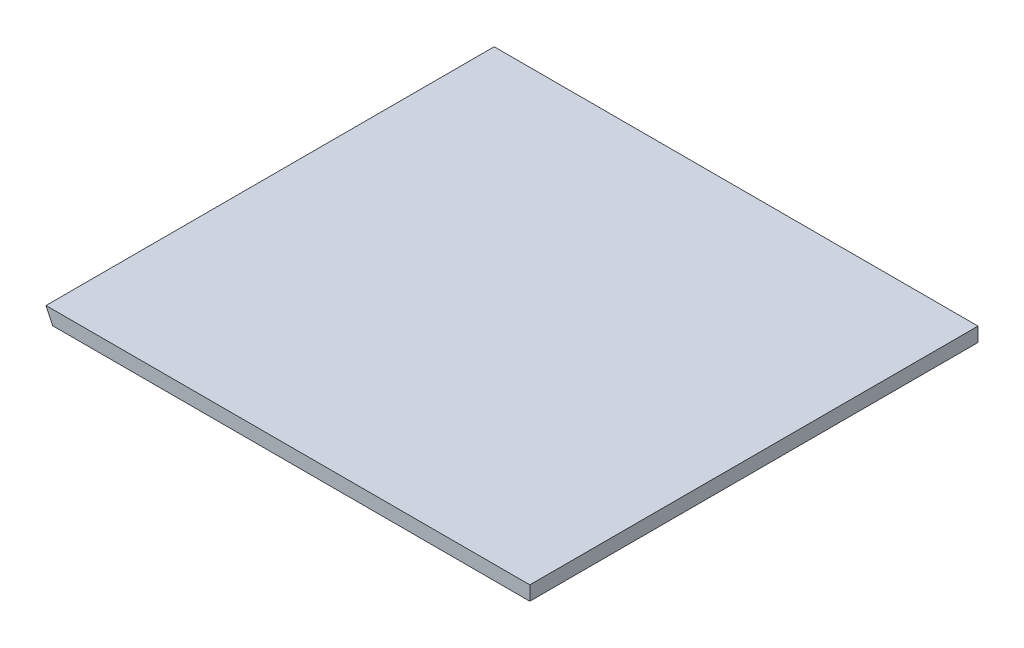
ISO-10303-21;
HEADER;
FILE_DESCRIPTION(('STEP AP214'),'2;1');
FILE_NAME('part.step','',(''),(''),'','','');
FILE_SCHEMA(('AUTOMOTIVE_DESIGN { 1 0 10303 214 1 1 1 1 }'));
ENDSEC;
DATA;
#1=APPLICATION_CONTEXT('core data for automotive mechanical design processes');
#2=APPLICATION_PROTOCOL_DEFINITION('international standard','automotive_design',2000,#1);
#3=PRODUCT_CONTEXT('',#1,'mechanical');
#4=PRODUCT('Part','Part','',(#3));
#5=PRODUCT_RELATED_PRODUCT_CATEGORY('part','',(#4));
#6=PRODUCT_DEFINITION_FORMATION('','',#4);
#7=PRODUCT_DEFINITION_CONTEXT('part definition',#1,'design');
#8=PRODUCT_DEFINITION('design','',#6,#7);
#9=PRODUCT_DEFINITION_SHAPE('','',#8);
#10=(LENGTH_UNIT() NAMED_UNIT(*) SI_UNIT(.MILLI.,.METRE.));
#11=(NAMED_UNIT(*) PLANE_ANGLE_UNIT() SI_UNIT($,.RADIAN.));
#12=(NAMED_UNIT(*) SI_UNIT($,.STERADIAN.) SOLID_ANGLE_UNIT());
#13=UNCERTAINTY_MEASURE_WITH_UNIT(LENGTH_MEASURE(1.E-05),#10,'distance_accuracy_value','');
#14=(GEOMETRIC_REPRESENTATION_CONTEXT(3) GLOBAL_UNCERTAINTY_ASSIGNED_CONTEXT((#13)) GLOBAL_UNIT_ASSIGNED_CONTEXT((#10,
#11,#12)) REPRESENTATION_CONTEXT('',''));
#15=CARTESIAN_POINT('',(0.,0.,0.));
#16=DIRECTION('',(0.,0.,1.));
#17=DIRECTION('',(1.,0.,0.));
#18=AXIS2_PLACEMENT_3D('',#15,#16,#17);
#19=CARTESIAN_POINT('',(0.,0.,0.));
#20=DIRECTION('',(0.,0.,-1.));
#21=DIRECTION('',(-1.,0.,0.));
#22=AXIS2_PLACEMENT_3D('',#19,#20,#21);
#23=PLANE('',#22);
#24=DIRECTION('',(1.,0.,0.));
#25=VECTOR('',#24,1.);
#26=CARTESIAN_POINT('',(-438.521287640416,22.2250000000001,0.));
#27=LINE('',#26,#25);
#28=CARTESIAN_POINT('',(-438.521287640416,22.2250000000001,0.));
#29=VERTEX_POINT('',#28);
#30=CARTESIAN_POINT('',(-12.7,22.225,0.));
#31=VERTEX_POINT('',#30);
#32=EDGE_CURVE('E88',#29,#31,#27,.T.);
#33=ORIENTED_EDGE('',*,*,#32,.F.);
#34=DIRECTION('',(0.426808919266064,-0.904341830523688,0.));
#35=VECTOR('',#34,1.);
#36=CARTESIAN_POINT('',(-438.521287640416,22.2250000000001,0.));
#37=LINE('',#36,#35);
#38=CARTESIAN_POINT('',(-444.51511994113,34.9250000000001,0.));
#39=VERTEX_POINT('',#38);
#40=EDGE_CURVE('E100',#39,#29,#37,.T.);
#41=ORIENTED_EDGE('',*,*,#40,.F.);
#42=DIRECTION('',(-1.,0.,0.));
#43=VECTOR('',#42,1.);
#44=CARTESIAN_POINT('',(-12.7,34.9250000000002,0.));
#45=LINE('',#44,#43);
#46=CARTESIAN_POINT('',(-12.7,34.9250000000002,0.));
#47=VERTEX_POINT('',#46);
#48=EDGE_CURVE('E90',#47,#39,#45,.T.);
#49=ORIENTED_EDGE('',*,*,#48,.F.);
#50=DIRECTION('',(0.,1.,0.));
#51=VECTOR('',#50,1.);
#52=CARTESIAN_POINT('',(-12.7,34.9250000000002,0.));
#53=LINE('',#52,#51);
#54=EDGE_CURVE('E79',#31,#47,#53,.T.);
#55=ORIENTED_EDGE('',*,*,#54,.F.);
#56=EDGE_LOOP('',(#33,#41,#49,#55));
#57=FACE_BOUND('',#56,.T.);
#58=ADVANCED_FACE('F37',(#57),#23,.T.);
#59=CARTESIAN_POINT('',(-438.521287640416,22.2250000000001,832.001837738883));
#60=DIRECTION('',(0.904341830523688,0.426808919266064,0.));
#61=DIRECTION('',(-0.426808919266064,0.904341830523688,0.));
#62=AXIS2_PLACEMENT_3D('',#59,#60,#61);
#63=PLANE('',#62);
#64=DIRECTION('',(0.,0.,-1.));
#65=VECTOR('',#64,1.);
#66=CARTESIAN_POINT('',(-438.521287640416,22.2250000000001,832.001837738883));
#67=LINE('',#66,#65);
#68=CARTESIAN_POINT('',(-438.521287640416,22.2250000000001,400.));
#69=VERTEX_POINT('',#68);
#70=EDGE_CURVE('E93',#69,#29,#67,.T.);
#71=ORIENTED_EDGE('',*,*,#70,.F.);
#72=DIRECTION('',(-0.426808919266064,0.904341830523688,0.));
#73=VECTOR('',#72,1.);
#74=CARTESIAN_POINT('',(-438.521287640416,22.2250000000001,400.));
#75=LINE('',#74,#73);
#76=CARTESIAN_POINT('',(-444.51511994113,34.9250000000001,400.));
#77=VERTEX_POINT('',#76);
#78=EDGE_CURVE('E52',#69,#77,#75,.T.);
#79=ORIENTED_EDGE('',*,*,#78,.T.);
#80=DIRECTION('',(0.,0.,-1.));
#81=VECTOR('',#80,1.);
#82=CARTESIAN_POINT('',(-444.51511994113,34.9250000000001,832.001837738883));
#83=LINE('',#82,#81);
#84=EDGE_CURVE('E103',#77,#39,#83,.T.);
#85=ORIENTED_EDGE('',*,*,#84,.T.);
#86=ORIENTED_EDGE('',*,*,#40,.T.);
#87=EDGE_LOOP('',(#71,#79,#85,#86));
#88=FACE_BOUND('',#87,.T.);
#89=ADVANCED_FACE('F118',(#88),#63,.F.);
#90=CARTESIAN_POINT('',(-12.7,34.9250000000002,832.001837738883));
#91=DIRECTION('',(0.,-1.,0.));
#92=DIRECTION('',(1.,0.,0.));
#93=AXIS2_PLACEMENT_3D('',#90,#91,#92);
#94=PLANE('',#93);
#95=ORIENTED_EDGE('',*,*,#84,.F.);
#96=DIRECTION('',(1.,0.,0.));
#97=VECTOR('',#96,1.);
#98=CARTESIAN_POINT('',(-12.7,34.9250000000002,400.));
#99=LINE('',#98,#97);
#100=CARTESIAN_POINT('',(-12.7,34.9250000000001,400.));
#101=VERTEX_POINT('',#100);
#102=EDGE_CURVE('E97',#77,#101,#99,.T.);
#103=ORIENTED_EDGE('',*,*,#102,.T.);
#104=DIRECTION('',(0.,0.,-1.));
#105=VECTOR('',#104,1.);
#106=CARTESIAN_POINT('',(-12.7,34.9250000000002,832.001837738883));
#107=LINE('',#106,#105);
#108=EDGE_CURVE('E83',#101,#47,#107,.T.);
#109=ORIENTED_EDGE('',*,*,#108,.T.);
#110=ORIENTED_EDGE('',*,*,#48,.T.);
#111=EDGE_LOOP('',(#95,#103,#109,#110));
#112=FACE_BOUND('',#111,.T.);
#113=ADVANCED_FACE('F108',(#112),#94,.F.);
#114=CARTESIAN_POINT('',(-12.7,34.9250000000002,832.001837738883));
#115=DIRECTION('',(-1.,0.,0.));
#116=DIRECTION('',(0.,-1.,0.));
#117=AXIS2_PLACEMENT_3D('',#114,#115,#116);
#118=PLANE('',#117);
#119=ORIENTED_EDGE('',*,*,#108,.F.);
#120=DIRECTION('',(0.,-1.,0.));
#121=VECTOR('',#120,1.);
#122=CARTESIAN_POINT('',(-12.7,34.9250000000002,400.));
#123=LINE('',#122,#121);
#124=CARTESIAN_POINT('',(-12.7,22.225,400.));
#125=VERTEX_POINT('',#124);
#126=EDGE_CURVE('E45',#101,#125,#123,.T.);
#127=ORIENTED_EDGE('',*,*,#126,.T.);
#128=DIRECTION('',(0.,0.,-1.));
#129=VECTOR('',#128,1.);
#130=CARTESIAN_POINT('',(-12.7,22.225,832.001837738883));
#131=LINE('',#130,#129);
#132=EDGE_CURVE('E75',#125,#31,#131,.T.);
#133=ORIENTED_EDGE('',*,*,#132,.T.);
#134=ORIENTED_EDGE('',*,*,#54,.T.);
#135=EDGE_LOOP('',(#119,#127,#133,#134));
#136=FACE_BOUND('',#135,.T.);
#137=ADVANCED_FACE('F78',(#136),#118,.F.);
#138=CARTESIAN_POINT('',(-438.521287640416,22.2250000000001,832.001837738883));
#139=DIRECTION('',(0.,1.,0.));
#140=DIRECTION('',(-1.,0.,0.));
#141=AXIS2_PLACEMENT_3D('',#138,#139,#140);
#142=PLANE('',#141);
#143=ORIENTED_EDGE('',*,*,#132,.F.);
#144=DIRECTION('',(-1.,0.,0.));
#145=VECTOR('',#144,1.);
#146=CARTESIAN_POINT('',(-438.521287640416,22.2250000000001,400.));
#147=LINE('',#146,#145);
#148=EDGE_CURVE('E11',#125,#69,#147,.T.);
#149=ORIENTED_EDGE('',*,*,#148,.T.);
#150=ORIENTED_EDGE('',*,*,#70,.T.);
#151=ORIENTED_EDGE('',*,*,#32,.T.);
#152=EDGE_LOOP('',(#143,#149,#150,#151));
#153=FACE_BOUND('',#152,.T.);
#154=ADVANCED_FACE('F39',(#153),#142,.F.);
#155=CARTESIAN_POINT('',(0.,0.,400.));
#156=DIRECTION('',(0.,0.,-1.));
#157=DIRECTION('',(-1.,0.,0.));
#158=AXIS2_PLACEMENT_3D('',#155,#156,#157);
#159=PLANE('',#158);
#160=ORIENTED_EDGE('',*,*,#78,.F.);
#161=ORIENTED_EDGE('',*,*,#148,.F.);
#162=ORIENTED_EDGE('',*,*,#126,.F.);
#163=ORIENTED_EDGE('',*,*,#102,.F.);
#164=EDGE_LOOP('',(#160,#161,#162,#163));
#165=FACE_BOUND('',#164,.T.);
#166=ADVANCED_FACE('F109',(#165),#159,.F.);
#167=CLOSED_SHELL('',(#58,#89,#113,#137,#154,#166));
#168=MANIFOLD_SOLID_BREP('B2',#167);
#169=ADVANCED_BREP_SHAPE_REPRESENTATION('',(#18,#168),#14);
#170=SHAPE_DEFINITION_REPRESENTATION(#9,#169);
ENDSEC;
END-ISO-10303-21;
